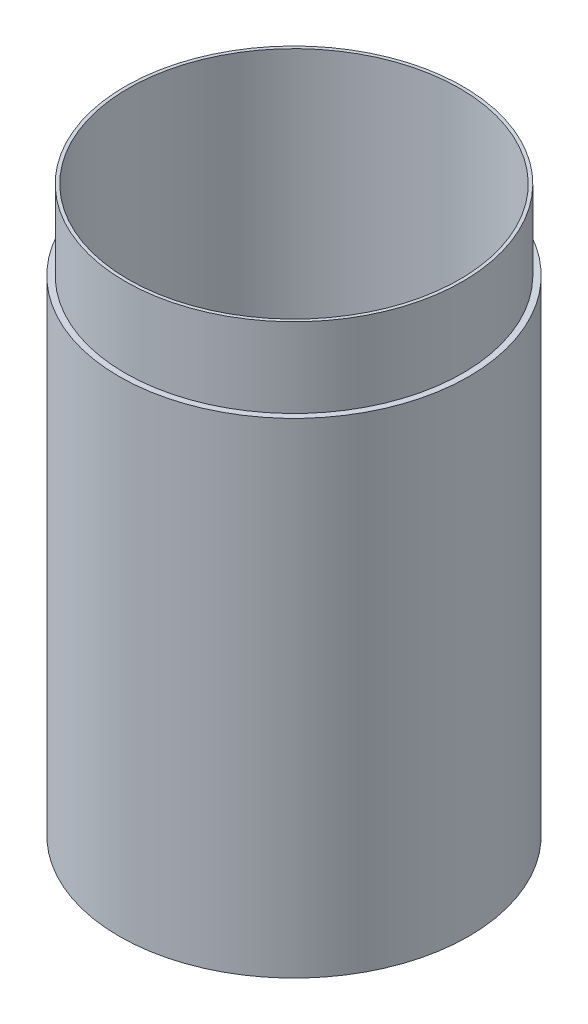
ISO-10303-21;
HEADER;
FILE_DESCRIPTION(('STEP AP214'),'2;1');
FILE_NAME('part.step','',(''),(''),'','','');
FILE_SCHEMA(('AUTOMOTIVE_DESIGN { 1 0 10303 214 1 1 1 1 }'));
ENDSEC;
DATA;
#1=APPLICATION_CONTEXT('core data for automotive mechanical design processes');
#2=APPLICATION_PROTOCOL_DEFINITION('international standard','automotive_design',2000,#1);
#3=PRODUCT_CONTEXT('',#1,'mechanical');
#4=PRODUCT('Part','Part','',(#3));
#5=PRODUCT_RELATED_PRODUCT_CATEGORY('part','',(#4));
#6=PRODUCT_DEFINITION_FORMATION('','',#4);
#7=PRODUCT_DEFINITION_CONTEXT('part definition',#1,'design');
#8=PRODUCT_DEFINITION('design','',#6,#7);
#9=PRODUCT_DEFINITION_SHAPE('','',#8);
#10=(LENGTH_UNIT() NAMED_UNIT(*) SI_UNIT(.MILLI.,.METRE.));
#11=(NAMED_UNIT(*) PLANE_ANGLE_UNIT() SI_UNIT($,.RADIAN.));
#12=(NAMED_UNIT(*) SI_UNIT($,.STERADIAN.) SOLID_ANGLE_UNIT());
#13=UNCERTAINTY_MEASURE_WITH_UNIT(LENGTH_MEASURE(1.E-05),#10,'distance_accuracy_value','');
#14=(GEOMETRIC_REPRESENTATION_CONTEXT(3) GLOBAL_UNCERTAINTY_ASSIGNED_CONTEXT((#13)) GLOBAL_UNIT_ASSIGNED_CONTEXT((#10,
#11,#12)) REPRESENTATION_CONTEXT('',''));
#15=CARTESIAN_POINT('',(0.,0.,0.));
#16=DIRECTION('',(0.,0.,1.));
#17=DIRECTION('',(1.,0.,0.));
#18=AXIS2_PLACEMENT_3D('',#15,#16,#17);
#19=CARTESIAN_POINT('',(0.,122.,0.));
#20=DIRECTION('',(0.,1.,0.));
#21=DIRECTION('',(0.,0.,1.));
#22=AXIS2_PLACEMENT_3D('',#19,#20,#21);
#23=PLANE('',#22);
#24=CARTESIAN_POINT('',(0.,122.,0.));
#25=DIRECTION('',(0.,1.,0.));
#26=DIRECTION('',(0.,0.,1.));
#27=AXIS2_PLACEMENT_3D('',#24,#25,#26);
#28=CIRCLE('',#27,44.);
#29=CARTESIAN_POINT('',(0.,122.,44.));
#30=VERTEX_POINT('',#29);
#31=EDGE_CURVE('E50',#30,#30,#28,.T.);
#32=ORIENTED_EDGE('',*,*,#31,.T.);
#33=EDGE_LOOP('',(#32));
#34=FACE_BOUND('',#33,.T.);
#35=CARTESIAN_POINT('',(0.,122.,0.));
#36=DIRECTION('',(0.,1.,0.));
#37=DIRECTION('',(0.,0.,1.));
#38=AXIS2_PLACEMENT_3D('',#35,#36,#37);
#39=CIRCLE('',#38,42.5);
#40=CARTESIAN_POINT('',(0.,122.,42.5));
#41=VERTEX_POINT('',#40);
#42=EDGE_CURVE('E55',#41,#41,#39,.T.);
#43=ORIENTED_EDGE('',*,*,#42,.F.);
#44=EDGE_LOOP('',(#43));
#45=FACE_BOUND('',#44,.T.);
#46=ADVANCED_FACE('F31',(#34,#45),#23,.T.);
#47=CARTESIAN_POINT('',(0.,22.,0.));
#48=DIRECTION('',(0.,1.,0.));
#49=DIRECTION('',(0.,0.,1.));
#50=AXIS2_PLACEMENT_3D('',#47,#48,#49);
#51=PLANE('',#50);
#52=CARTESIAN_POINT('',(0.,22.,0.));
#53=DIRECTION('',(0.,1.,0.));
#54=DIRECTION('',(0.,0.,1.));
#55=AXIS2_PLACEMENT_3D('',#52,#53,#54);
#56=CIRCLE('',#55,40.);
#57=CARTESIAN_POINT('',(0.,22.,40.));
#58=VERTEX_POINT('',#57);
#59=EDGE_CURVE('E42',#58,#58,#56,.T.);
#60=ORIENTED_EDGE('',*,*,#59,.F.);
#61=EDGE_LOOP('',(#60));
#62=FACE_BOUND('',#61,.T.);
#63=CARTESIAN_POINT('',(0.,22.,0.));
#64=DIRECTION('',(0.,1.,0.));
#65=DIRECTION('',(0.,0.,1.));
#66=AXIS2_PLACEMENT_3D('',#63,#64,#65);
#67=CIRCLE('',#66,41.68814);
#68=CARTESIAN_POINT('',(0.,22.,41.68814));
#69=VERTEX_POINT('',#68);
#70=EDGE_CURVE('E10',#69,#69,#67,.F.);
#71=ORIENTED_EDGE('',*,*,#70,.F.);
#72=EDGE_LOOP('',(#71));
#73=FACE_BOUND('',#72,.T.);
#74=ADVANCED_FACE('F80',(#62,#73),#51,.T.);
#75=CARTESIAN_POINT('',(0.,0.,0.));
#76=DIRECTION('',(0.,1.,0.));
#77=DIRECTION('',(0.,0.,1.));
#78=AXIS2_PLACEMENT_3D('',#75,#76,#77);
#79=PLANE('',#78);
#80=CARTESIAN_POINT('',(0.,0.,0.));
#81=DIRECTION('',(0.,1.,0.));
#82=DIRECTION('',(0.,0.,1.));
#83=AXIS2_PLACEMENT_3D('',#80,#81,#82);
#84=CIRCLE('',#83,44.);
#85=CARTESIAN_POINT('',(0.,0.,44.));
#86=VERTEX_POINT('',#85);
#87=EDGE_CURVE('E38',#86,#86,#84,.T.);
#88=ORIENTED_EDGE('',*,*,#87,.F.);
#89=EDGE_LOOP('',(#88));
#90=FACE_BOUND('',#89,.T.);
#91=CARTESIAN_POINT('',(0.,0.,0.));
#92=DIRECTION('',(0.,1.,0.));
#93=DIRECTION('',(0.,0.,1.));
#94=AXIS2_PLACEMENT_3D('',#91,#92,#93);
#95=CIRCLE('',#94,40.);
#96=CARTESIAN_POINT('',(0.,0.,40.));
#97=VERTEX_POINT('',#96);
#98=EDGE_CURVE('E46',#97,#97,#95,.T.);
#99=ORIENTED_EDGE('',*,*,#98,.T.);
#100=EDGE_LOOP('',(#99));
#101=FACE_BOUND('',#100,.T.);
#102=ADVANCED_FACE('F86',(#90,#101),#79,.F.);
#103=CARTESIAN_POINT('',(0.,22.,0.));
#104=DIRECTION('',(0.,-1.,0.));
#105=DIRECTION('',(0.,0.,-1.));
#106=AXIS2_PLACEMENT_3D('',#103,#104,#105);
#107=CYLINDRICAL_SURFACE('',#106,44.);
#108=ORIENTED_EDGE('',*,*,#87,.T.);
#109=EDGE_LOOP('',(#108));
#110=FACE_BOUND('',#109,.T.);
#111=ORIENTED_EDGE('',*,*,#31,.F.);
#112=EDGE_LOOP('',(#111));
#113=FACE_BOUND('',#112,.T.);
#114=ADVANCED_FACE('F33',(#110,#113),#107,.T.);
#115=CARTESIAN_POINT('',(0.,22.,0.));
#116=DIRECTION('',(0.,-1.,0.));
#117=DIRECTION('',(0.,0.,-1.));
#118=AXIS2_PLACEMENT_3D('',#115,#116,#117);
#119=CYLINDRICAL_SURFACE('',#118,40.);
#120=ORIENTED_EDGE('',*,*,#59,.T.);
#121=EDGE_LOOP('',(#120));
#122=FACE_BOUND('',#121,.T.);
#123=ORIENTED_EDGE('',*,*,#98,.F.);
#124=EDGE_LOOP('',(#123));
#125=FACE_BOUND('',#124,.T.);
#126=ADVANCED_FACE('F77',(#122,#125),#119,.F.);
#127=CARTESIAN_POINT('',(0.,122.,0.));
#128=DIRECTION('',(0.,-1.,0.));
#129=DIRECTION('',(0.,0.,-1.));
#130=AXIS2_PLACEMENT_3D('',#127,#128,#129);
#131=CYLINDRICAL_SURFACE('',#130,41.68814);
#132=ORIENTED_EDGE('',*,*,#70,.T.);
#133=EDGE_LOOP('',(#132));
#134=FACE_BOUND('',#133,.T.);
#135=CARTESIAN_POINT('',(0.,142.,0.));
#136=DIRECTION('',(0.,1.,0.));
#137=DIRECTION('',(0.,0.,1.));
#138=AXIS2_PLACEMENT_3D('',#135,#136,#137);
#139=CIRCLE('',#138,41.68814);
#140=CARTESIAN_POINT('',(0.,142.,41.68814));
#141=VERTEX_POINT('',#140);
#142=EDGE_CURVE('E58',#141,#141,#139,.T.);
#143=ORIENTED_EDGE('',*,*,#142,.T.);
#144=EDGE_LOOP('',(#143));
#145=FACE_BOUND('',#144,.T.);
#146=ADVANCED_FACE('F64',(#134,#145),#131,.F.);
#147=CARTESIAN_POINT('',(0.,142.,0.));
#148=DIRECTION('',(0.,1.,0.));
#149=DIRECTION('',(0.,0.,1.));
#150=AXIS2_PLACEMENT_3D('',#147,#148,#149);
#151=PLANE('',#150);
#152=CARTESIAN_POINT('',(0.,142.,0.));
#153=DIRECTION('',(0.,1.,0.));
#154=DIRECTION('',(0.,0.,1.));
#155=AXIS2_PLACEMENT_3D('',#152,#153,#154);
#156=CIRCLE('',#155,42.5);
#157=CARTESIAN_POINT('',(0.,142.,42.5));
#158=VERTEX_POINT('',#157);
#159=EDGE_CURVE('E54',#158,#158,#156,.T.);
#160=ORIENTED_EDGE('',*,*,#159,.T.);
#161=EDGE_LOOP('',(#160));
#162=FACE_BOUND('',#161,.T.);
#163=ORIENTED_EDGE('',*,*,#142,.F.);
#164=EDGE_LOOP('',(#163));
#165=FACE_BOUND('',#164,.T.);
#166=ADVANCED_FACE('F66',(#162,#165),#151,.T.);
#167=CARTESIAN_POINT('',(0.,142.,0.));
#168=DIRECTION('',(0.,-1.,0.));
#169=DIRECTION('',(0.,0.,-1.));
#170=AXIS2_PLACEMENT_3D('',#167,#168,#169);
#171=CYLINDRICAL_SURFACE('',#170,42.5);
#172=ORIENTED_EDGE('',*,*,#159,.F.);
#173=EDGE_LOOP('',(#172));
#174=FACE_BOUND('',#173,.T.);
#175=ORIENTED_EDGE('',*,*,#42,.T.);
#176=EDGE_LOOP('',(#175));
#177=FACE_BOUND('',#176,.T.);
#178=ADVANCED_FACE('F68',(#174,#177),#171,.T.);
#179=CLOSED_SHELL('',(#46,#74,#102,#114,#126,#146,#166,#178));
#180=MANIFOLD_SOLID_BREP('B2',#179);
#181=ADVANCED_BREP_SHAPE_REPRESENTATION('',(#18,#180),#14);
#182=SHAPE_DEFINITION_REPRESENTATION(#9,#181);
ENDSEC;
END-ISO-10303-21;
